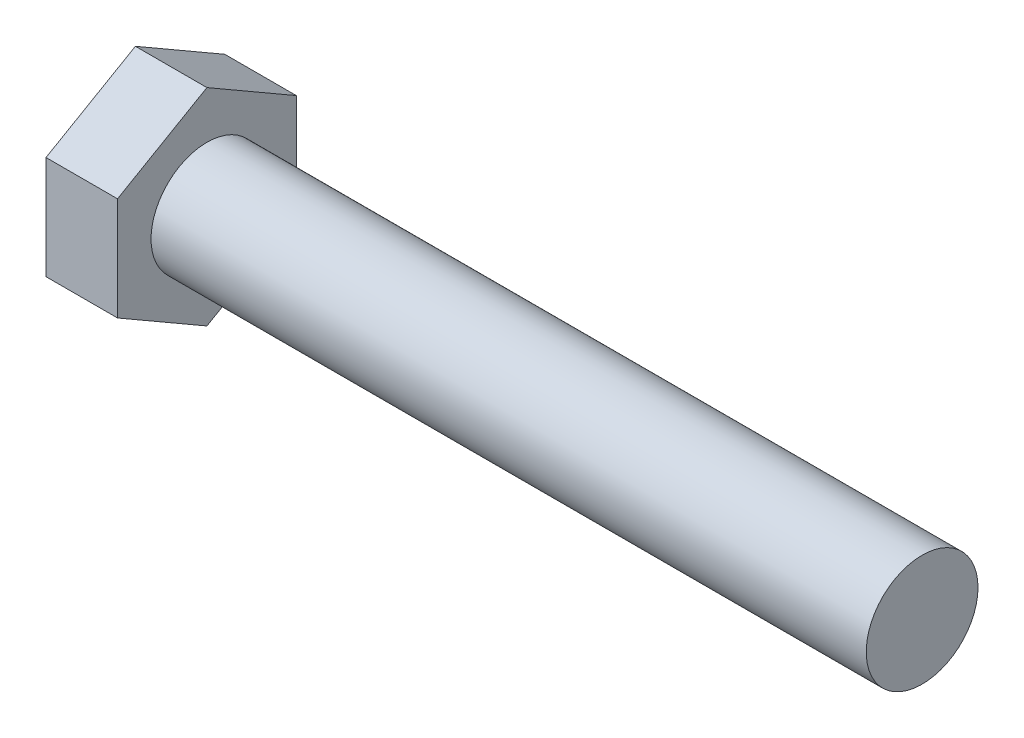
ISO-10303-21;
HEADER;
FILE_DESCRIPTION(('STEP AP214'),'2;1');
FILE_NAME('part.step','',(''),(''),'','','');
FILE_SCHEMA(('AUTOMOTIVE_DESIGN { 1 0 10303 214 1 1 1 1 }'));
ENDSEC;
DATA;
#1=APPLICATION_CONTEXT('core data for automotive mechanical design processes');
#2=APPLICATION_PROTOCOL_DEFINITION('international standard','automotive_design',2000,#1);
#3=PRODUCT_CONTEXT('',#1,'mechanical');
#4=PRODUCT('Part','Part','',(#3));
#5=PRODUCT_RELATED_PRODUCT_CATEGORY('part','',(#4));
#6=PRODUCT_DEFINITION_FORMATION('','',#4);
#7=PRODUCT_DEFINITION_CONTEXT('part definition',#1,'design');
#8=PRODUCT_DEFINITION('design','',#6,#7);
#9=PRODUCT_DEFINITION_SHAPE('','',#8);
#10=(LENGTH_UNIT() NAMED_UNIT(*) SI_UNIT(.MILLI.,.METRE.));
#11=(NAMED_UNIT(*) PLANE_ANGLE_UNIT() SI_UNIT($,.RADIAN.));
#12=(NAMED_UNIT(*) SI_UNIT($,.STERADIAN.) SOLID_ANGLE_UNIT());
#13=UNCERTAINTY_MEASURE_WITH_UNIT(LENGTH_MEASURE(1.E-05),#10,'distance_accuracy_value','');
#14=(GEOMETRIC_REPRESENTATION_CONTEXT(3) GLOBAL_UNCERTAINTY_ASSIGNED_CONTEXT((#13)) GLOBAL_UNIT_ASSIGNED_CONTEXT((#10,
#11,#12)) REPRESENTATION_CONTEXT('',''));
#15=CARTESIAN_POINT('',(0.,0.,0.));
#16=DIRECTION('',(0.,0.,1.));
#17=DIRECTION('',(1.,0.,0.));
#18=AXIS2_PLACEMENT_3D('',#15,#16,#17);
#19=CARTESIAN_POINT('',(5.08,-3.66617420935401,-6.35));
#20=DIRECTION('',(0.,0.,1.));
#21=DIRECTION('',(0.,-1.,0.));
#22=AXIS2_PLACEMENT_3D('',#19,#20,#21);
#23=PLANE('',#22);
#24=DIRECTION('',(0.,1.,0.));
#25=VECTOR('',#24,1.);
#26=CARTESIAN_POINT('',(0.,-3.66617420935401,-6.35));
#27=LINE('',#26,#25);
#28=CARTESIAN_POINT('',(0.,-3.66617420935401,-6.35));
#29=VERTEX_POINT('',#28);
#30=CARTESIAN_POINT('',(0.,3.66617420935424,-6.35));
#31=VERTEX_POINT('',#30);
#32=EDGE_CURVE('E118',#29,#31,#27,.T.);
#33=ORIENTED_EDGE('',*,*,#32,.T.);
#34=DIRECTION('',(-1.,0.,0.));
#35=VECTOR('',#34,1.);
#36=CARTESIAN_POINT('',(5.08,3.66617420935424,-6.35));
#37=LINE('',#36,#35);
#38=CARTESIAN_POINT('',(5.08,3.66617420935424,-6.35));
#39=VERTEX_POINT('',#38);
#40=EDGE_CURVE('E11',#39,#31,#37,.T.);
#41=ORIENTED_EDGE('',*,*,#40,.F.);
#42=DIRECTION('',(0.,1.,0.));
#43=VECTOR('',#42,1.);
#44=CARTESIAN_POINT('',(5.08,-3.66617420935401,-6.35));
#45=LINE('',#44,#43);
#46=CARTESIAN_POINT('',(5.08,-3.66617420935401,-6.35));
#47=VERTEX_POINT('',#46);
#48=EDGE_CURVE('E129',#47,#39,#45,.T.);
#49=ORIENTED_EDGE('',*,*,#48,.F.);
#50=DIRECTION('',(-1.,0.,0.));
#51=VECTOR('',#50,1.);
#52=CARTESIAN_POINT('',(5.08,-3.66617420935401,-6.35));
#53=LINE('',#52,#51);
#54=EDGE_CURVE('E114',#47,#29,#53,.T.);
#55=ORIENTED_EDGE('',*,*,#54,.T.);
#56=EDGE_LOOP('',(#33,#41,#49,#55));
#57=FACE_BOUND('',#56,.T.);
#58=ADVANCED_FACE('F34',(#57),#23,.F.);
#59=CARTESIAN_POINT('',(5.08,3.66617420935424,-6.35));
#60=DIRECTION('',(0.,-0.866025403784439,0.5));
#61=DIRECTION('',(0.,-0.5,-0.866025403784439));
#62=AXIS2_PLACEMENT_3D('',#59,#60,#61);
#63=PLANE('',#62);
#64=DIRECTION('',(0.,0.5,0.866025403784439));
#65=VECTOR('',#64,1.);
#66=CARTESIAN_POINT('',(0.,3.66617420935424,-6.35));
#67=LINE('',#66,#65);
#68=CARTESIAN_POINT('',(0.,7.33234841870836,0.));
#69=VERTEX_POINT('',#68);
#70=EDGE_CURVE('E121',#31,#69,#67,.T.);
#71=ORIENTED_EDGE('',*,*,#70,.T.);
#72=DIRECTION('',(-1.,0.,0.));
#73=VECTOR('',#72,1.);
#74=CARTESIAN_POINT('',(5.08,7.33234841870836,0.));
#75=LINE('',#74,#73);
#76=CARTESIAN_POINT('',(5.08,7.33234841870836,0.));
#77=VERTEX_POINT('',#76);
#78=EDGE_CURVE('E42',#77,#69,#75,.T.);
#79=ORIENTED_EDGE('',*,*,#78,.F.);
#80=DIRECTION('',(0.,0.5,0.866025403784439));
#81=VECTOR('',#80,1.);
#82=CARTESIAN_POINT('',(5.08,3.66617420935424,-6.35));
#83=LINE('',#82,#81);
#84=EDGE_CURVE('E87',#39,#77,#83,.T.);
#85=ORIENTED_EDGE('',*,*,#84,.F.);
#86=ORIENTED_EDGE('',*,*,#40,.T.);
#87=EDGE_LOOP('',(#71,#79,#85,#86));
#88=FACE_BOUND('',#87,.T.);
#89=ADVANCED_FACE('F154',(#88),#63,.F.);
#90=CARTESIAN_POINT('',(5.08,7.33234841870836,0.));
#91=DIRECTION('',(0.,-0.866025403784439,-0.5));
#92=DIRECTION('',(0.,0.5,-0.866025403784439));
#93=AXIS2_PLACEMENT_3D('',#90,#91,#92);
#94=PLANE('',#93);
#95=DIRECTION('',(0.,-0.5,0.866025403784439));
#96=VECTOR('',#95,1.);
#97=CARTESIAN_POINT('',(0.,7.33234841870836,0.));
#98=LINE('',#97,#96);
#99=CARTESIAN_POINT('',(0.,3.66617420935424,6.35));
#100=VERTEX_POINT('',#99);
#101=EDGE_CURVE('E124',#69,#100,#98,.T.);
#102=ORIENTED_EDGE('',*,*,#101,.T.);
#103=DIRECTION('',(-1.,0.,0.));
#104=VECTOR('',#103,1.);
#105=CARTESIAN_POINT('',(5.08,3.66617420935424,6.35));
#106=LINE('',#105,#104);
#107=CARTESIAN_POINT('',(5.08,3.66617420935424,6.35));
#108=VERTEX_POINT('',#107);
#109=EDGE_CURVE('E109',#108,#100,#106,.T.);
#110=ORIENTED_EDGE('',*,*,#109,.F.);
#111=DIRECTION('',(0.,-0.5,0.866025403784439));
#112=VECTOR('',#111,1.);
#113=CARTESIAN_POINT('',(5.08,7.33234841870836,0.));
#114=LINE('',#113,#112);
#115=EDGE_CURVE('E100',#77,#108,#114,.T.);
#116=ORIENTED_EDGE('',*,*,#115,.F.);
#117=ORIENTED_EDGE('',*,*,#78,.T.);
#118=EDGE_LOOP('',(#102,#110,#116,#117));
#119=FACE_BOUND('',#118,.T.);
#120=ADVANCED_FACE('F135',(#119),#94,.F.);
#121=CARTESIAN_POINT('',(5.08,3.66617420935424,6.35));
#122=DIRECTION('',(0.,0.,-1.));
#123=DIRECTION('',(-1.,0.,0.));
#124=AXIS2_PLACEMENT_3D('',#121,#122,#123);
#125=PLANE('',#124);
#126=DIRECTION('',(0.,-1.,0.));
#127=VECTOR('',#126,1.);
#128=CARTESIAN_POINT('',(0.,3.66617420935424,6.35));
#129=LINE('',#128,#127);
#130=CARTESIAN_POINT('',(0.,-3.66617420935401,6.35));
#131=VERTEX_POINT('',#130);
#132=EDGE_CURVE('E108',#100,#131,#129,.T.);
#133=ORIENTED_EDGE('',*,*,#132,.T.);
#134=DIRECTION('',(-1.,0.,0.));
#135=VECTOR('',#134,1.);
#136=CARTESIAN_POINT('',(5.08,-3.66617420935401,6.35));
#137=LINE('',#136,#135);
#138=CARTESIAN_POINT('',(5.08,-3.66617420935401,6.35));
#139=VERTEX_POINT('',#138);
#140=EDGE_CURVE('E105',#139,#131,#137,.T.);
#141=ORIENTED_EDGE('',*,*,#140,.F.);
#142=DIRECTION('',(0.,-1.,0.));
#143=VECTOR('',#142,1.);
#144=CARTESIAN_POINT('',(5.08,3.66617420935424,6.35));
#145=LINE('',#144,#143);
#146=EDGE_CURVE('E94',#108,#139,#145,.T.);
#147=ORIENTED_EDGE('',*,*,#146,.F.);
#148=ORIENTED_EDGE('',*,*,#109,.T.);
#149=EDGE_LOOP('',(#133,#141,#147,#148));
#150=FACE_BOUND('',#149,.T.);
#151=ADVANCED_FACE('F106',(#150),#125,.F.);
#152=CARTESIAN_POINT('',(5.08,-3.66617420935401,6.35));
#153=DIRECTION('',(0.,0.866025403784438,-0.5));
#154=DIRECTION('',(0.,0.5,0.866025403784439));
#155=AXIS2_PLACEMENT_3D('',#152,#153,#154);
#156=PLANE('',#155);
#157=DIRECTION('',(0.,-0.5,-0.866025403784439));
#158=VECTOR('',#157,1.);
#159=CARTESIAN_POINT('',(0.,-3.66617420935401,6.35));
#160=LINE('',#159,#158);
#161=CARTESIAN_POINT('',(0.,-7.33234841870813,0.));
#162=VERTEX_POINT('',#161);
#163=EDGE_CURVE('E73',#131,#162,#160,.T.);
#164=ORIENTED_EDGE('',*,*,#163,.T.);
#165=DIRECTION('',(-1.,0.,0.));
#166=VECTOR('',#165,1.);
#167=CARTESIAN_POINT('',(5.08,-7.33234841870813,0.));
#168=LINE('',#167,#166);
#169=CARTESIAN_POINT('',(5.08,-7.33234841870813,0.));
#170=VERTEX_POINT('',#169);
#171=EDGE_CURVE('E110',#170,#162,#168,.T.);
#172=ORIENTED_EDGE('',*,*,#171,.F.);
#173=DIRECTION('',(0.,-0.5,-0.866025403784439));
#174=VECTOR('',#173,1.);
#175=CARTESIAN_POINT('',(5.08,-3.66617420935401,6.35));
#176=LINE('',#175,#174);
#177=EDGE_CURVE('E98',#139,#170,#176,.T.);
#178=ORIENTED_EDGE('',*,*,#177,.F.);
#179=ORIENTED_EDGE('',*,*,#140,.T.);
#180=EDGE_LOOP('',(#164,#172,#178,#179));
#181=FACE_BOUND('',#180,.T.);
#182=ADVANCED_FACE('F112',(#181),#156,.F.);
#183=CARTESIAN_POINT('',(5.08,-7.33234841870813,0.));
#184=DIRECTION('',(0.,0.866025403784438,0.5));
#185=DIRECTION('',(0.,-0.5,0.866025403784438));
#186=AXIS2_PLACEMENT_3D('',#183,#184,#185);
#187=PLANE('',#186);
#188=DIRECTION('',(0.,0.5,-0.866025403784438));
#189=VECTOR('',#188,1.);
#190=CARTESIAN_POINT('',(0.,-7.33234841870813,0.));
#191=LINE('',#190,#189);
#192=EDGE_CURVE('E79',#162,#29,#191,.T.);
#193=ORIENTED_EDGE('',*,*,#192,.T.);
#194=ORIENTED_EDGE('',*,*,#54,.F.);
#195=DIRECTION('',(0.,0.5,-0.866025403784438));
#196=VECTOR('',#195,1.);
#197=CARTESIAN_POINT('',(5.08,-7.33234841870813,0.));
#198=LINE('',#197,#196);
#199=EDGE_CURVE('E50',#170,#47,#198,.T.);
#200=ORIENTED_EDGE('',*,*,#199,.F.);
#201=ORIENTED_EDGE('',*,*,#171,.T.);
#202=EDGE_LOOP('',(#193,#194,#200,#201));
#203=FACE_BOUND('',#202,.T.);
#204=ADVANCED_FACE('F142',(#203),#187,.F.);
#205=CARTESIAN_POINT('',(5.08,0.,0.));
#206=DIRECTION('',(1.,0.,0.));
#207=DIRECTION('',(0.,0.,-1.));
#208=AXIS2_PLACEMENT_3D('',#205,#206,#207);
#209=PLANE('',#208);
#210=CARTESIAN_POINT('',(5.08,0.,0.));
#211=DIRECTION('',(1.,0.,0.));
#212=DIRECTION('',(0.,0.,-1.));
#213=AXIS2_PLACEMENT_3D('',#210,#211,#212);
#214=CIRCLE('',#213,3.96875);
#215=CARTESIAN_POINT('',(5.08,0.,-3.96875));
#216=VERTEX_POINT('',#215);
#217=EDGE_CURVE('E215',#216,#216,#214,.T.);
#218=ORIENTED_EDGE('',*,*,#217,.F.);
#219=EDGE_LOOP('',(#218));
#220=FACE_BOUND('',#219,.T.);
#221=ORIENTED_EDGE('',*,*,#48,.T.);
#222=ORIENTED_EDGE('',*,*,#84,.T.);
#223=ORIENTED_EDGE('',*,*,#115,.T.);
#224=ORIENTED_EDGE('',*,*,#146,.T.);
#225=ORIENTED_EDGE('',*,*,#177,.T.);
#226=ORIENTED_EDGE('',*,*,#199,.T.);
#227=EDGE_LOOP('',(#221,#222,#223,#224,#225,#226));
#228=FACE_BOUND('',#227,.T.);
#229=ADVANCED_FACE('F96',(#220,#228),#209,.T.);
#230=CARTESIAN_POINT('',(0.,0.,0.));
#231=DIRECTION('',(1.,0.,0.));
#232=DIRECTION('',(0.,0.,-1.));
#233=AXIS2_PLACEMENT_3D('',#230,#231,#232);
#234=PLANE('',#233);
#235=ORIENTED_EDGE('',*,*,#32,.F.);
#236=ORIENTED_EDGE('',*,*,#192,.F.);
#237=ORIENTED_EDGE('',*,*,#163,.F.);
#238=ORIENTED_EDGE('',*,*,#132,.F.);
#239=ORIENTED_EDGE('',*,*,#101,.F.);
#240=ORIENTED_EDGE('',*,*,#70,.F.);
#241=EDGE_LOOP('',(#235,#236,#237,#238,#239,#240));
#242=FACE_BOUND('',#241,.T.);
#243=ADVANCED_FACE('F138',(#242),#234,.F.);
#244=CARTESIAN_POINT('',(55.88,0.,0.));
#245=DIRECTION('',(-1.,0.,0.));
#246=DIRECTION('',(0.,0.,1.));
#247=AXIS2_PLACEMENT_3D('',#244,#245,#246);
#248=CYLINDRICAL_SURFACE('',#247,3.96875);
#249=CARTESIAN_POINT('',(55.88,0.,0.));
#250=DIRECTION('',(1.,0.,0.));
#251=DIRECTION('',(0.,0.,-1.));
#252=AXIS2_PLACEMENT_3D('',#249,#250,#251);
#253=CIRCLE('',#252,3.96875);
#254=CARTESIAN_POINT('',(55.88,0.,-3.96875));
#255=VERTEX_POINT('',#254);
#256=EDGE_CURVE('E122',#255,#255,#253,.T.);
#257=ORIENTED_EDGE('',*,*,#256,.F.);
#258=EDGE_LOOP('',(#257));
#259=FACE_BOUND('',#258,.T.);
#260=ORIENTED_EDGE('',*,*,#217,.T.);
#261=EDGE_LOOP('',(#260));
#262=FACE_BOUND('',#261,.T.);
#263=ADVANCED_FACE('F186',(#259,#262),#248,.T.);
#264=CARTESIAN_POINT('',(55.88,0.,0.));
#265=DIRECTION('',(1.,0.,0.));
#266=DIRECTION('',(0.,0.,-1.));
#267=AXIS2_PLACEMENT_3D('',#264,#265,#266);
#268=PLANE('',#267);
#269=ORIENTED_EDGE('',*,*,#256,.T.);
#270=EDGE_LOOP('',(#269));
#271=FACE_BOUND('',#270,.T.);
#272=ADVANCED_FACE('F199',(#271),#268,.T.);
#273=CLOSED_SHELL('',(#58,#89,#120,#151,#182,#204,#229,#243,#263,#272));
#274=MANIFOLD_SOLID_BREP('B2',#273);
#275=ADVANCED_BREP_SHAPE_REPRESENTATION('',(#18,#274),#14);
#276=SHAPE_DEFINITION_REPRESENTATION(#9,#275);
ENDSEC;
END-ISO-10303-21;
